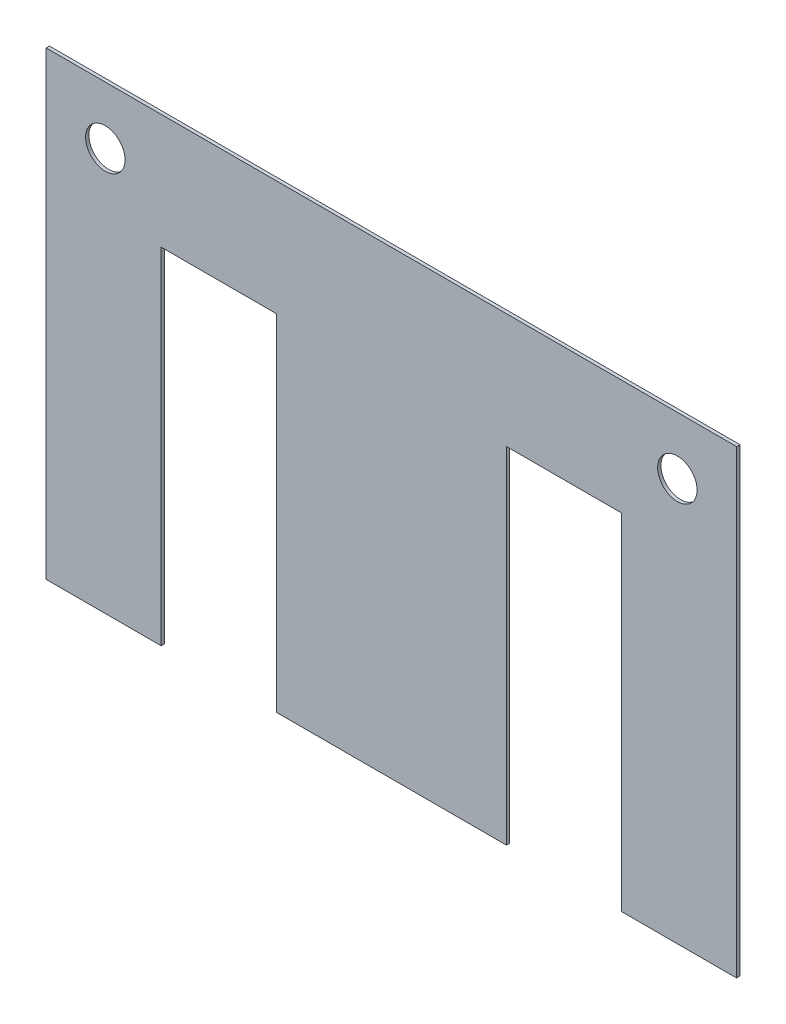
ISO-10303-21;
HEADER;
FILE_DESCRIPTION(('STEP AP214'),'2;1');
FILE_NAME('part.step','',(''),(''),'','','');
FILE_SCHEMA(('AUTOMOTIVE_DESIGN { 1 0 10303 214 1 1 1 1 }'));
ENDSEC;
DATA;
#1=APPLICATION_CONTEXT('core data for automotive mechanical design processes');
#2=APPLICATION_PROTOCOL_DEFINITION('international standard','automotive_design',2000,#1);
#3=PRODUCT_CONTEXT('',#1,'mechanical');
#4=PRODUCT('Part','Part','',(#3));
#5=PRODUCT_RELATED_PRODUCT_CATEGORY('part','',(#4));
#6=PRODUCT_DEFINITION_FORMATION('','',#4);
#7=PRODUCT_DEFINITION_CONTEXT('part definition',#1,'design');
#8=PRODUCT_DEFINITION('design','',#6,#7);
#9=PRODUCT_DEFINITION_SHAPE('','',#8);
#10=(LENGTH_UNIT() NAMED_UNIT(*) SI_UNIT(.MILLI.,.METRE.));
#11=(NAMED_UNIT(*) PLANE_ANGLE_UNIT() SI_UNIT($,.RADIAN.));
#12=(NAMED_UNIT(*) SI_UNIT($,.STERADIAN.) SOLID_ANGLE_UNIT());
#13=UNCERTAINTY_MEASURE_WITH_UNIT(LENGTH_MEASURE(1.E-05),#10,'distance_accuracy_value','');
#14=(GEOMETRIC_REPRESENTATION_CONTEXT(3) GLOBAL_UNCERTAINTY_ASSIGNED_CONTEXT((#13)) GLOBAL_UNIT_ASSIGNED_CONTEXT((#10,
#11,#12)) REPRESENTATION_CONTEXT('',''));
#15=CARTESIAN_POINT('',(0.,0.,0.));
#16=DIRECTION('',(0.,0.,1.));
#17=DIRECTION('',(1.,0.,0.));
#18=AXIS2_PLACEMENT_3D('',#15,#16,#17);
#19=CARTESIAN_POINT('',(0.,0.,0.5));
#20=DIRECTION('',(0.,0.,-1.));
#21=DIRECTION('',(-1.,0.,0.));
#22=AXIS2_PLACEMENT_3D('',#19,#20,#21);
#23=PLANE('',#22);
#24=CARTESIAN_POINT('',(9.,61.25,0.5));
#25=DIRECTION('',(0.,0.,1.));
#26=DIRECTION('',(1.,0.,0.));
#27=AXIS2_PLACEMENT_3D('',#24,#25,#26);
#28=CIRCLE('',#27,3.);
#29=CARTESIAN_POINT('',(12.,61.25,0.5));
#30=VERTEX_POINT('',#29);
#31=EDGE_CURVE('E159',#30,#30,#28,.T.);
#32=ORIENTED_EDGE('',*,*,#31,.F.);
#33=EDGE_LOOP('',(#32));
#34=FACE_BOUND('',#33,.T.);
#35=DIRECTION('',(1.,0.,0.));
#36=VECTOR('',#35,1.);
#37=CARTESIAN_POINT('',(17.5,0.,0.5));
#38=LINE('',#37,#36);
#39=CARTESIAN_POINT('',(0.,0.,0.5));
#40=VERTEX_POINT('',#39);
#41=CARTESIAN_POINT('',(17.5,0.,0.5));
#42=VERTEX_POINT('',#41);
#43=EDGE_CURVE('E178',#40,#42,#38,.T.);
#44=ORIENTED_EDGE('',*,*,#43,.T.);
#45=DIRECTION('',(0.,1.,0.));
#46=VECTOR('',#45,1.);
#47=CARTESIAN_POINT('',(17.5,52.5,0.5));
#48=LINE('',#47,#46);
#49=CARTESIAN_POINT('',(17.5,52.5,0.5));
#50=VERTEX_POINT('',#49);
#51=EDGE_CURVE('E106',#42,#50,#48,.T.);
#52=ORIENTED_EDGE('',*,*,#51,.T.);
#53=DIRECTION('',(1.,0.,0.));
#54=VECTOR('',#53,1.);
#55=CARTESIAN_POINT('',(35.,52.5,0.5));
#56=LINE('',#55,#54);
#57=CARTESIAN_POINT('',(35.,52.5,0.5));
#58=VERTEX_POINT('',#57);
#59=EDGE_CURVE('E205',#50,#58,#56,.T.);
#60=ORIENTED_EDGE('',*,*,#59,.T.);
#61=DIRECTION('',(0.,-1.,0.));
#62=VECTOR('',#61,1.);
#63=CARTESIAN_POINT('',(35.,0.,0.5));
#64=LINE('',#63,#62);
#65=CARTESIAN_POINT('',(35.,0.,0.5));
#66=VERTEX_POINT('',#65);
#67=EDGE_CURVE('E224',#58,#66,#64,.T.);
#68=ORIENTED_EDGE('',*,*,#67,.T.);
#69=DIRECTION('',(1.,0.,0.));
#70=VECTOR('',#69,1.);
#71=CARTESIAN_POINT('',(70.,0.,0.5));
#72=LINE('',#71,#70);
#73=CARTESIAN_POINT('',(70.,0.,0.5));
#74=VERTEX_POINT('',#73);
#75=EDGE_CURVE('E221',#66,#74,#72,.T.);
#76=ORIENTED_EDGE('',*,*,#75,.T.);
#77=DIRECTION('',(0.,1.,0.));
#78=VECTOR('',#77,1.);
#79=CARTESIAN_POINT('',(70.,52.5,0.5));
#80=LINE('',#79,#78);
#81=CARTESIAN_POINT('',(70.,52.5,0.5));
#82=VERTEX_POINT('',#81);
#83=EDGE_CURVE('E223',#74,#82,#80,.T.);
#84=ORIENTED_EDGE('',*,*,#83,.T.);
#85=DIRECTION('',(1.,0.,0.));
#86=VECTOR('',#85,1.);
#87=CARTESIAN_POINT('',(87.5,52.5,0.5));
#88=LINE('',#87,#86);
#89=CARTESIAN_POINT('',(87.5,52.5,0.5));
#90=VERTEX_POINT('',#89);
#91=EDGE_CURVE('E226',#82,#90,#88,.T.);
#92=ORIENTED_EDGE('',*,*,#91,.T.);
#93=DIRECTION('',(0.,-1.,0.));
#94=VECTOR('',#93,1.);
#95=CARTESIAN_POINT('',(87.5,0.,0.5));
#96=LINE('',#95,#94);
#97=CARTESIAN_POINT('',(87.5,0.,0.5));
#98=VERTEX_POINT('',#97);
#99=EDGE_CURVE('E232',#90,#98,#96,.T.);
#100=ORIENTED_EDGE('',*,*,#99,.T.);
#101=DIRECTION('',(1.,0.,0.));
#102=VECTOR('',#101,1.);
#103=CARTESIAN_POINT('',(105.,0.,0.5));
#104=LINE('',#103,#102);
#105=CARTESIAN_POINT('',(105.,0.,0.5));
#106=VERTEX_POINT('',#105);
#107=EDGE_CURVE('E137',#98,#106,#104,.T.);
#108=ORIENTED_EDGE('',*,*,#107,.T.);
#109=DIRECTION('',(0.,1.,0.));
#110=VECTOR('',#109,1.);
#111=CARTESIAN_POINT('',(105.,70.,0.5));
#112=LINE('',#111,#110);
#113=CARTESIAN_POINT('',(105.,70.,0.5));
#114=VERTEX_POINT('',#113);
#115=EDGE_CURVE('E131',#106,#114,#112,.T.);
#116=ORIENTED_EDGE('',*,*,#115,.T.);
#117=DIRECTION('',(-1.,0.,0.));
#118=VECTOR('',#117,1.);
#119=CARTESIAN_POINT('',(0.,70.,0.5));
#120=LINE('',#119,#118);
#121=CARTESIAN_POINT('',(0.,70.,0.5));
#122=VERTEX_POINT('',#121);
#123=EDGE_CURVE('E135',#114,#122,#120,.T.);
#124=ORIENTED_EDGE('',*,*,#123,.T.);
#125=DIRECTION('',(0.,-1.,0.));
#126=VECTOR('',#125,1.);
#127=CARTESIAN_POINT('',(0.,0.,0.5));
#128=LINE('',#127,#126);
#129=EDGE_CURVE('E51',#122,#40,#128,.T.);
#130=ORIENTED_EDGE('',*,*,#129,.T.);
#131=EDGE_LOOP('',(#44,#52,#60,#68,#76,#84,#92,#100,#108,#116,#124,#130));
#132=FACE_BOUND('',#131,.T.);
#133=CARTESIAN_POINT('',(96.,61.25,0.5));
#134=DIRECTION('',(0.,0.,1.));
#135=DIRECTION('',(1.,0.,0.));
#136=AXIS2_PLACEMENT_3D('',#133,#134,#135);
#137=CIRCLE('',#136,3.00000000000001);
#138=CARTESIAN_POINT('',(99.,61.25,0.5));
#139=VERTEX_POINT('',#138);
#140=EDGE_CURVE('E275',#139,#139,#137,.T.);
#141=ORIENTED_EDGE('',*,*,#140,.F.);
#142=EDGE_LOOP('',(#141));
#143=FACE_BOUND('',#142,.T.);
#144=ADVANCED_FACE('F34',(#34,#132,#143),#23,.F.);
#145=CARTESIAN_POINT('',(0.,0.,0.));
#146=DIRECTION('',(0.,0.,-1.));
#147=DIRECTION('',(-1.,0.,0.));
#148=AXIS2_PLACEMENT_3D('',#145,#146,#147);
#149=PLANE('',#148);
#150=CARTESIAN_POINT('',(9.,61.25,0.));
#151=DIRECTION('',(0.,0.,1.));
#152=DIRECTION('',(1.,0.,0.));
#153=AXIS2_PLACEMENT_3D('',#150,#151,#152);
#154=CIRCLE('',#153,3.);
#155=CARTESIAN_POINT('',(12.,61.25,0.));
#156=VERTEX_POINT('',#155);
#157=EDGE_CURVE('E280',#156,#156,#154,.T.);
#158=ORIENTED_EDGE('',*,*,#157,.T.);
#159=EDGE_LOOP('',(#158));
#160=FACE_BOUND('',#159,.T.);
#161=DIRECTION('',(1.,0.,0.));
#162=VECTOR('',#161,1.);
#163=CARTESIAN_POINT('',(17.5,0.,0.));
#164=LINE('',#163,#162);
#165=CARTESIAN_POINT('',(0.,0.,0.));
#166=VERTEX_POINT('',#165);
#167=CARTESIAN_POINT('',(17.5,0.,0.));
#168=VERTEX_POINT('',#167);
#169=EDGE_CURVE('E155',#166,#168,#164,.T.);
#170=ORIENTED_EDGE('',*,*,#169,.F.);
#171=DIRECTION('',(0.,-1.,0.));
#172=VECTOR('',#171,1.);
#173=CARTESIAN_POINT('',(0.,0.,0.));
#174=LINE('',#173,#172);
#175=CARTESIAN_POINT('',(0.,70.,0.));
#176=VERTEX_POINT('',#175);
#177=EDGE_CURVE('E98',#176,#166,#174,.T.);
#178=ORIENTED_EDGE('',*,*,#177,.F.);
#179=DIRECTION('',(-1.,0.,0.));
#180=VECTOR('',#179,1.);
#181=CARTESIAN_POINT('',(0.,70.,0.));
#182=LINE('',#181,#180);
#183=CARTESIAN_POINT('',(105.,70.,0.));
#184=VERTEX_POINT('',#183);
#185=EDGE_CURVE('E92',#184,#176,#182,.T.);
#186=ORIENTED_EDGE('',*,*,#185,.F.);
#187=DIRECTION('',(0.,1.,0.));
#188=VECTOR('',#187,1.);
#189=CARTESIAN_POINT('',(105.,70.,0.));
#190=LINE('',#189,#188);
#191=CARTESIAN_POINT('',(105.,0.,0.));
#192=VERTEX_POINT('',#191);
#193=EDGE_CURVE('E145',#192,#184,#190,.T.);
#194=ORIENTED_EDGE('',*,*,#193,.F.);
#195=DIRECTION('',(1.,0.,0.));
#196=VECTOR('',#195,1.);
#197=CARTESIAN_POINT('',(105.,0.,0.));
#198=LINE('',#197,#196);
#199=CARTESIAN_POINT('',(87.5,0.,0.));
#200=VERTEX_POINT('',#199);
#201=EDGE_CURVE('E173',#200,#192,#198,.T.);
#202=ORIENTED_EDGE('',*,*,#201,.F.);
#203=DIRECTION('',(0.,-1.,0.));
#204=VECTOR('',#203,1.);
#205=CARTESIAN_POINT('',(87.5,0.,0.));
#206=LINE('',#205,#204);
#207=CARTESIAN_POINT('',(87.5,52.5,0.));
#208=VERTEX_POINT('',#207);
#209=EDGE_CURVE('E171',#208,#200,#206,.T.);
#210=ORIENTED_EDGE('',*,*,#209,.F.);
#211=DIRECTION('',(1.,0.,0.));
#212=VECTOR('',#211,1.);
#213=CARTESIAN_POINT('',(87.5,52.5,0.));
#214=LINE('',#213,#212);
#215=CARTESIAN_POINT('',(70.,52.5,0.));
#216=VERTEX_POINT('',#215);
#217=EDGE_CURVE('E169',#216,#208,#214,.T.);
#218=ORIENTED_EDGE('',*,*,#217,.F.);
#219=DIRECTION('',(0.,1.,0.));
#220=VECTOR('',#219,1.);
#221=CARTESIAN_POINT('',(70.,52.5,0.));
#222=LINE('',#221,#220);
#223=CARTESIAN_POINT('',(70.,0.,0.));
#224=VERTEX_POINT('',#223);
#225=EDGE_CURVE('E167',#224,#216,#222,.T.);
#226=ORIENTED_EDGE('',*,*,#225,.F.);
#227=DIRECTION('',(1.,0.,0.));
#228=VECTOR('',#227,1.);
#229=CARTESIAN_POINT('',(70.,0.,0.));
#230=LINE('',#229,#228);
#231=CARTESIAN_POINT('',(35.,0.,0.));
#232=VERTEX_POINT('',#231);
#233=EDGE_CURVE('E165',#232,#224,#230,.T.);
#234=ORIENTED_EDGE('',*,*,#233,.F.);
#235=DIRECTION('',(0.,-1.,0.));
#236=VECTOR('',#235,1.);
#237=CARTESIAN_POINT('',(35.,0.,0.));
#238=LINE('',#237,#236);
#239=CARTESIAN_POINT('',(35.,52.5,0.));
#240=VERTEX_POINT('',#239);
#241=EDGE_CURVE('E163',#240,#232,#238,.T.);
#242=ORIENTED_EDGE('',*,*,#241,.F.);
#243=DIRECTION('',(1.,0.,0.));
#244=VECTOR('',#243,1.);
#245=CARTESIAN_POINT('',(35.,52.5,0.));
#246=LINE('',#245,#244);
#247=CARTESIAN_POINT('',(17.5,52.5,0.));
#248=VERTEX_POINT('',#247);
#249=EDGE_CURVE('E161',#248,#240,#246,.T.);
#250=ORIENTED_EDGE('',*,*,#249,.F.);
#251=DIRECTION('',(0.,1.,0.));
#252=VECTOR('',#251,1.);
#253=CARTESIAN_POINT('',(17.5,52.5,0.));
#254=LINE('',#253,#252);
#255=EDGE_CURVE('E158',#168,#248,#254,.T.);
#256=ORIENTED_EDGE('',*,*,#255,.F.);
#257=EDGE_LOOP('',(#170,#178,#186,#194,#202,#210,#218,#226,#234,#242,#250,#256));
#258=FACE_BOUND('',#257,.T.);
#259=CARTESIAN_POINT('',(96.,61.25,0.));
#260=DIRECTION('',(0.,0.,1.));
#261=DIRECTION('',(1.,0.,0.));
#262=AXIS2_PLACEMENT_3D('',#259,#260,#261);
#263=CIRCLE('',#262,3.00000000000001);
#264=CARTESIAN_POINT('',(99.,61.25,0.));
#265=VERTEX_POINT('',#264);
#266=EDGE_CURVE('E278',#265,#265,#263,.T.);
#267=ORIENTED_EDGE('',*,*,#266,.T.);
#268=EDGE_LOOP('',(#267));
#269=FACE_BOUND('',#268,.T.);
#270=ADVANCED_FACE('F209',(#160,#258,#269),#149,.T.);
#271=CARTESIAN_POINT('',(17.5,0.,0.5));
#272=DIRECTION('',(0.,1.,0.));
#273=DIRECTION('',(-1.,0.,0.));
#274=AXIS2_PLACEMENT_3D('',#271,#272,#273);
#275=PLANE('',#274);
#276=ORIENTED_EDGE('',*,*,#169,.T.);
#277=DIRECTION('',(0.,0.,-1.));
#278=VECTOR('',#277,1.);
#279=CARTESIAN_POINT('',(17.5,0.,0.5));
#280=LINE('',#279,#278);
#281=EDGE_CURVE('E11',#42,#168,#280,.T.);
#282=ORIENTED_EDGE('',*,*,#281,.F.);
#283=ORIENTED_EDGE('',*,*,#43,.F.);
#284=DIRECTION('',(0.,0.,-1.));
#285=VECTOR('',#284,1.);
#286=CARTESIAN_POINT('',(0.,0.,0.5));
#287=LINE('',#286,#285);
#288=EDGE_CURVE('E151',#40,#166,#287,.T.);
#289=ORIENTED_EDGE('',*,*,#288,.T.);
#290=EDGE_LOOP('',(#276,#282,#283,#289));
#291=FACE_BOUND('',#290,.T.);
#292=ADVANCED_FACE('F36',(#291),#275,.F.);
#293=CARTESIAN_POINT('',(17.5,52.5,0.5));
#294=DIRECTION('',(-1.,0.,0.));
#295=DIRECTION('',(0.,-1.,0.));
#296=AXIS2_PLACEMENT_3D('',#293,#294,#295);
#297=PLANE('',#296);
#298=ORIENTED_EDGE('',*,*,#255,.T.);
#299=DIRECTION('',(0.,0.,-1.));
#300=VECTOR('',#299,1.);
#301=CARTESIAN_POINT('',(17.5,52.5,0.5));
#302=LINE('',#301,#300);
#303=EDGE_CURVE('E43',#50,#248,#302,.T.);
#304=ORIENTED_EDGE('',*,*,#303,.F.);
#305=ORIENTED_EDGE('',*,*,#51,.F.);
#306=ORIENTED_EDGE('',*,*,#281,.T.);
#307=EDGE_LOOP('',(#298,#304,#305,#306));
#308=FACE_BOUND('',#307,.T.);
#309=ADVANCED_FACE('F373',(#308),#297,.F.);
#310=CARTESIAN_POINT('',(35.,52.5,0.5));
#311=DIRECTION('',(0.,1.,0.));
#312=DIRECTION('',(0.,0.,1.));
#313=AXIS2_PLACEMENT_3D('',#310,#311,#312);
#314=PLANE('',#313);
#315=ORIENTED_EDGE('',*,*,#249,.T.);
#316=DIRECTION('',(0.,0.,-1.));
#317=VECTOR('',#316,1.);
#318=CARTESIAN_POINT('',(35.,52.5,0.5));
#319=LINE('',#318,#317);
#320=EDGE_CURVE('E197',#58,#240,#319,.T.);
#321=ORIENTED_EDGE('',*,*,#320,.F.);
#322=ORIENTED_EDGE('',*,*,#59,.F.);
#323=ORIENTED_EDGE('',*,*,#303,.T.);
#324=EDGE_LOOP('',(#315,#321,#322,#323));
#325=FACE_BOUND('',#324,.T.);
#326=ADVANCED_FACE('F203',(#325),#314,.F.);
#327=CARTESIAN_POINT('',(35.,0.,0.5));
#328=DIRECTION('',(1.,0.,0.));
#329=DIRECTION('',(0.,0.,-1.));
#330=AXIS2_PLACEMENT_3D('',#327,#328,#329);
#331=PLANE('',#330);
#332=ORIENTED_EDGE('',*,*,#241,.T.);
#333=DIRECTION('',(0.,0.,-1.));
#334=VECTOR('',#333,1.);
#335=CARTESIAN_POINT('',(35.,0.,0.5));
#336=LINE('',#335,#334);
#337=EDGE_CURVE('E194',#66,#232,#336,.T.);
#338=ORIENTED_EDGE('',*,*,#337,.F.);
#339=ORIENTED_EDGE('',*,*,#67,.F.);
#340=ORIENTED_EDGE('',*,*,#320,.T.);
#341=EDGE_LOOP('',(#332,#338,#339,#340));
#342=FACE_BOUND('',#341,.T.);
#343=ADVANCED_FACE('F215',(#342),#331,.F.);
#344=CARTESIAN_POINT('',(70.,0.,0.5));
#345=DIRECTION('',(0.,1.,0.));
#346=DIRECTION('',(-1.,0.,0.));
#347=AXIS2_PLACEMENT_3D('',#344,#345,#346);
#348=PLANE('',#347);
#349=ORIENTED_EDGE('',*,*,#233,.T.);
#350=DIRECTION('',(0.,0.,-1.));
#351=VECTOR('',#350,1.);
#352=CARTESIAN_POINT('',(70.,0.,0.5));
#353=LINE('',#352,#351);
#354=EDGE_CURVE('E191',#74,#224,#353,.T.);
#355=ORIENTED_EDGE('',*,*,#354,.F.);
#356=ORIENTED_EDGE('',*,*,#75,.F.);
#357=ORIENTED_EDGE('',*,*,#337,.T.);
#358=EDGE_LOOP('',(#349,#355,#356,#357));
#359=FACE_BOUND('',#358,.T.);
#360=ADVANCED_FACE('F219',(#359),#348,.F.);
#361=CARTESIAN_POINT('',(70.,52.5,0.5));
#362=DIRECTION('',(-1.,0.,0.));
#363=DIRECTION('',(0.,0.,1.));
#364=AXIS2_PLACEMENT_3D('',#361,#362,#363);
#365=PLANE('',#364);
#366=ORIENTED_EDGE('',*,*,#225,.T.);
#367=DIRECTION('',(0.,0.,-1.));
#368=VECTOR('',#367,1.);
#369=CARTESIAN_POINT('',(70.,52.5,0.5));
#370=LINE('',#369,#368);
#371=EDGE_CURVE('E188',#82,#216,#370,.T.);
#372=ORIENTED_EDGE('',*,*,#371,.F.);
#373=ORIENTED_EDGE('',*,*,#83,.F.);
#374=ORIENTED_EDGE('',*,*,#354,.T.);
#375=EDGE_LOOP('',(#366,#372,#373,#374));
#376=FACE_BOUND('',#375,.T.);
#377=ADVANCED_FACE('F338',(#376),#365,.F.);
#378=CARTESIAN_POINT('',(87.5,52.5,0.5));
#379=DIRECTION('',(0.,1.,0.));
#380=DIRECTION('',(0.,0.,1.));
#381=AXIS2_PLACEMENT_3D('',#378,#379,#380);
#382=PLANE('',#381);
#383=ORIENTED_EDGE('',*,*,#217,.T.);
#384=DIRECTION('',(0.,0.,-1.));
#385=VECTOR('',#384,1.);
#386=CARTESIAN_POINT('',(87.5,52.5,0.5));
#387=LINE('',#386,#385);
#388=EDGE_CURVE('E185',#90,#208,#387,.T.);
#389=ORIENTED_EDGE('',*,*,#388,.F.);
#390=ORIENTED_EDGE('',*,*,#91,.F.);
#391=ORIENTED_EDGE('',*,*,#371,.T.);
#392=EDGE_LOOP('',(#383,#389,#390,#391));
#393=FACE_BOUND('',#392,.T.);
#394=ADVANCED_FACE('F329',(#393),#382,.F.);
#395=CARTESIAN_POINT('',(87.5,0.,0.5));
#396=DIRECTION('',(1.,0.,0.));
#397=DIRECTION('',(0.,0.,-1.));
#398=AXIS2_PLACEMENT_3D('',#395,#396,#397);
#399=PLANE('',#398);
#400=ORIENTED_EDGE('',*,*,#209,.T.);
#401=DIRECTION('',(0.,0.,-1.));
#402=VECTOR('',#401,1.);
#403=CARTESIAN_POINT('',(87.5,0.,0.5));
#404=LINE('',#403,#402);
#405=EDGE_CURVE('E182',#98,#200,#404,.T.);
#406=ORIENTED_EDGE('',*,*,#405,.F.);
#407=ORIENTED_EDGE('',*,*,#99,.F.);
#408=ORIENTED_EDGE('',*,*,#388,.T.);
#409=EDGE_LOOP('',(#400,#406,#407,#408));
#410=FACE_BOUND('',#409,.T.);
#411=ADVANCED_FACE('F238',(#410),#399,.F.);
#412=CARTESIAN_POINT('',(105.,0.,0.5));
#413=DIRECTION('',(0.,1.,0.));
#414=DIRECTION('',(-1.,0.,0.));
#415=AXIS2_PLACEMENT_3D('',#412,#413,#414);
#416=PLANE('',#415);
#417=ORIENTED_EDGE('',*,*,#201,.T.);
#418=DIRECTION('',(0.,0.,-1.));
#419=VECTOR('',#418,1.);
#420=CARTESIAN_POINT('',(105.,0.,0.5));
#421=LINE('',#420,#419);
#422=EDGE_CURVE('E146',#106,#192,#421,.T.);
#423=ORIENTED_EDGE('',*,*,#422,.F.);
#424=ORIENTED_EDGE('',*,*,#107,.F.);
#425=ORIENTED_EDGE('',*,*,#405,.T.);
#426=EDGE_LOOP('',(#417,#423,#424,#425));
#427=FACE_BOUND('',#426,.T.);
#428=ADVANCED_FACE('F242',(#427),#416,.F.);
#429=CARTESIAN_POINT('',(105.,70.,0.5));
#430=DIRECTION('',(-1.,0.,0.));
#431=DIRECTION('',(0.,-1.,0.));
#432=AXIS2_PLACEMENT_3D('',#429,#430,#431);
#433=PLANE('',#432);
#434=ORIENTED_EDGE('',*,*,#193,.T.);
#435=DIRECTION('',(0.,0.,-1.));
#436=VECTOR('',#435,1.);
#437=CARTESIAN_POINT('',(105.,70.,0.5));
#438=LINE('',#437,#436);
#439=EDGE_CURVE('E142',#114,#184,#438,.T.);
#440=ORIENTED_EDGE('',*,*,#439,.F.);
#441=ORIENTED_EDGE('',*,*,#115,.F.);
#442=ORIENTED_EDGE('',*,*,#422,.T.);
#443=EDGE_LOOP('',(#434,#440,#441,#442));
#444=FACE_BOUND('',#443,.T.);
#445=ADVANCED_FACE('F143',(#444),#433,.F.);
#446=CARTESIAN_POINT('',(0.,70.,0.5));
#447=DIRECTION('',(0.,-1.,0.));
#448=DIRECTION('',(0.,0.,-1.));
#449=AXIS2_PLACEMENT_3D('',#446,#447,#448);
#450=PLANE('',#449);
#451=ORIENTED_EDGE('',*,*,#185,.T.);
#452=DIRECTION('',(0.,0.,-1.));
#453=VECTOR('',#452,1.);
#454=CARTESIAN_POINT('',(0.,70.,0.5));
#455=LINE('',#454,#453);
#456=EDGE_CURVE('E147',#122,#176,#455,.T.);
#457=ORIENTED_EDGE('',*,*,#456,.F.);
#458=ORIENTED_EDGE('',*,*,#123,.F.);
#459=ORIENTED_EDGE('',*,*,#439,.T.);
#460=EDGE_LOOP('',(#451,#457,#458,#459));
#461=FACE_BOUND('',#460,.T.);
#462=ADVANCED_FACE('F149',(#461),#450,.F.);
#463=CARTESIAN_POINT('',(0.,0.,0.5));
#464=DIRECTION('',(1.,0.,0.));
#465=DIRECTION('',(0.,1.,0.));
#466=AXIS2_PLACEMENT_3D('',#463,#464,#465);
#467=PLANE('',#466);
#468=ORIENTED_EDGE('',*,*,#177,.T.);
#469=ORIENTED_EDGE('',*,*,#288,.F.);
#470=ORIENTED_EDGE('',*,*,#129,.F.);
#471=ORIENTED_EDGE('',*,*,#456,.T.);
#472=EDGE_LOOP('',(#468,#469,#470,#471));
#473=FACE_BOUND('',#472,.T.);
#474=ADVANCED_FACE('F246',(#473),#467,.F.);
#475=CARTESIAN_POINT('',(9.,61.25,0.5));
#476=DIRECTION('',(0.,0.,-1.));
#477=DIRECTION('',(-1.,0.,0.));
#478=AXIS2_PLACEMENT_3D('',#475,#476,#477);
#479=CYLINDRICAL_SURFACE('',#478,3.);
#480=ORIENTED_EDGE('',*,*,#31,.T.);
#481=EDGE_LOOP('',(#480));
#482=FACE_BOUND('',#481,.T.);
#483=ORIENTED_EDGE('',*,*,#157,.F.);
#484=EDGE_LOOP('',(#483));
#485=FACE_BOUND('',#484,.T.);
#486=ADVANCED_FACE('F248',(#482,#485),#479,.F.);
#487=CARTESIAN_POINT('',(96.,61.25,0.5));
#488=DIRECTION('',(0.,0.,-1.));
#489=DIRECTION('',(-1.,0.,0.));
#490=AXIS2_PLACEMENT_3D('',#487,#488,#489);
#491=CYLINDRICAL_SURFACE('',#490,3.00000000000001);
#492=ORIENTED_EDGE('',*,*,#140,.T.);
#493=EDGE_LOOP('',(#492));
#494=FACE_BOUND('',#493,.T.);
#495=ORIENTED_EDGE('',*,*,#266,.F.);
#496=EDGE_LOOP('',(#495));
#497=FACE_BOUND('',#496,.T.);
#498=ADVANCED_FACE('F254',(#494,#497),#491,.F.);
#499=CLOSED_SHELL('',(#144,#270,#292,#309,#326,#343,#360,#377,#394,#411,#428,#445,#462,#474,
#486,#498));
#500=MANIFOLD_SOLID_BREP('B2',#499);
#501=ADVANCED_BREP_SHAPE_REPRESENTATION('',(#18,#500),#14);
#502=SHAPE_DEFINITION_REPRESENTATION(#9,#501);
ENDSEC;
END-ISO-10303-21;
